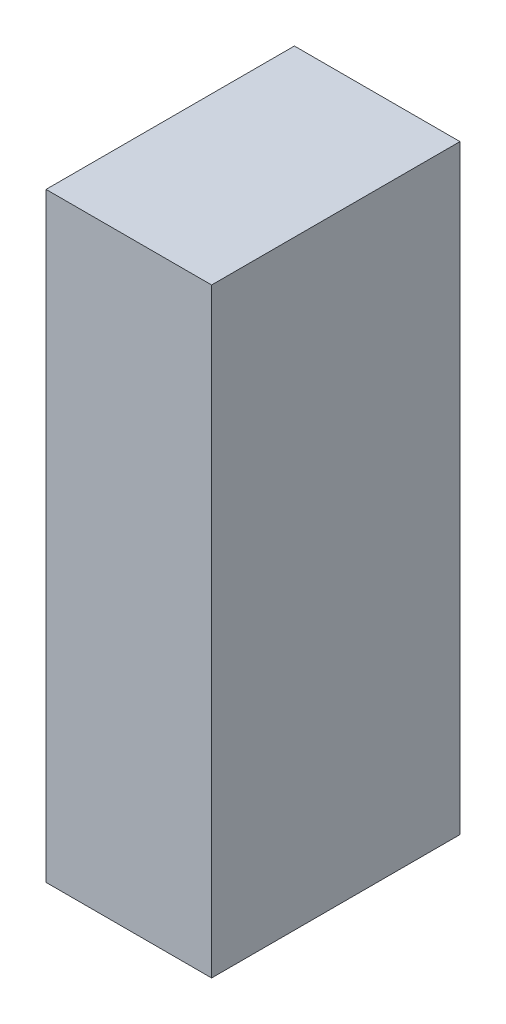
ISO-10303-21;
HEADER;
FILE_DESCRIPTION(('STEP AP214'),'2;1');
FILE_NAME('part.step','',(''),(''),'','','');
FILE_SCHEMA(('AUTOMOTIVE_DESIGN { 1 0 10303 214 1 1 1 1 }'));
ENDSEC;
DATA;
#1=APPLICATION_CONTEXT('core data for automotive mechanical design processes');
#2=APPLICATION_PROTOCOL_DEFINITION('international standard','automotive_design',2000,#1);
#3=PRODUCT_CONTEXT('',#1,'mechanical');
#4=PRODUCT('Part','Part','',(#3));
#5=PRODUCT_RELATED_PRODUCT_CATEGORY('part','',(#4));
#6=PRODUCT_DEFINITION_FORMATION('','',#4);
#7=PRODUCT_DEFINITION_CONTEXT('part definition',#1,'design');
#8=PRODUCT_DEFINITION('design','',#6,#7);
#9=PRODUCT_DEFINITION_SHAPE('','',#8);
#10=(LENGTH_UNIT() NAMED_UNIT(*) SI_UNIT(.MILLI.,.METRE.));
#11=(NAMED_UNIT(*) PLANE_ANGLE_UNIT() SI_UNIT($,.RADIAN.));
#12=(NAMED_UNIT(*) SI_UNIT($,.STERADIAN.) SOLID_ANGLE_UNIT());
#13=UNCERTAINTY_MEASURE_WITH_UNIT(LENGTH_MEASURE(1.E-05),#10,'distance_accuracy_value','');
#14=(GEOMETRIC_REPRESENTATION_CONTEXT(3) GLOBAL_UNCERTAINTY_ASSIGNED_CONTEXT((#13)) GLOBAL_UNIT_ASSIGNED_CONTEXT((#10,
#11,#12)) REPRESENTATION_CONTEXT('',''));
#15=CARTESIAN_POINT('',(0.,0.,0.));
#16=DIRECTION('',(0.,0.,1.));
#17=DIRECTION('',(1.,0.,0.));
#18=AXIS2_PLACEMENT_3D('',#15,#16,#17);
#19=CARTESIAN_POINT('',(0.699992179626449,0.724992261998693,0.));
#20=DIRECTION('',(-1.,1.19248806385031E-08,0.));
#21=DIRECTION('',(-1.19248806385031E-08,-1.,0.));
#22=AXIS2_PLACEMENT_3D('',#19,#20,#21);
#23=PLANE('',#22);
#24=DIRECTION('',(-1.1924880607005E-08,-1.,0.));
#25=VECTOR('',#24,1.);
#26=CARTESIAN_POINT('',(0.699992179626449,0.724992261998693,0.));
#27=LINE('',#26,#25);
#28=CARTESIAN_POINT('',(0.699992179626449,0.724992261998693,0.));
#29=VERTEX_POINT('',#28);
#30=CARTESIAN_POINT('',(0.699992162335406,-0.725004686243494,0.));
#31=VERTEX_POINT('',#30);
#32=EDGE_CURVE('E11',#29,#31,#27,.T.);
#33=ORIENTED_EDGE('',*,*,#32,.T.);
#34=DIRECTION('',(0.,0.,1.));
#35=VECTOR('',#34,1.);
#36=CARTESIAN_POINT('',(0.699992162335408,-0.725004686243494,0.));
#37=LINE('',#36,#35);
#38=CARTESIAN_POINT('',(0.699992162335406,-0.725004686243494,0.599998772144318));
#39=VERTEX_POINT('',#38);
#40=EDGE_CURVE('E88',#31,#39,#37,.T.);
#41=ORIENTED_EDGE('',*,*,#40,.T.);
#42=DIRECTION('',(-1.1924880607005E-08,-1.,0.));
#43=VECTOR('',#42,1.);
#44=CARTESIAN_POINT('',(0.699992179626449,0.724992261998693,0.599998772144318));
#45=LINE('',#44,#43);
#46=CARTESIAN_POINT('',(0.699992179626449,0.724992261998693,0.599998772144318));
#47=VERTEX_POINT('',#46);
#48=EDGE_CURVE('E83',#47,#39,#45,.T.);
#49=ORIENTED_EDGE('',*,*,#48,.F.);
#50=DIRECTION('',(0.,0.,1.));
#51=VECTOR('',#50,1.);
#52=CARTESIAN_POINT('',(0.699992179626449,0.724992261998705,0.));
#53=LINE('',#52,#51);
#54=EDGE_CURVE('E72',#29,#47,#53,.T.);
#55=ORIENTED_EDGE('',*,*,#54,.F.);
#56=EDGE_LOOP('',(#33,#41,#49,#55));
#57=FACE_BOUND('',#56,.T.);
#58=ADVANCED_FACE('F17',(#57),#23,.T.);
#59=CARTESIAN_POINT('',(0.699992162335406,-0.725004686243494,0.));
#60=DIRECTION('',(-1.19248806385031E-08,-1.,0.));
#61=DIRECTION('',(1.,-1.19248806385031E-08,0.));
#62=AXIS2_PLACEMENT_3D('',#59,#60,#61);
#63=PLANE('',#62);
#64=DIRECTION('',(1.,-1.19248805568155E-08,0.));
#65=VECTOR('',#64,1.);
#66=CARTESIAN_POINT('',(0.699992162335406,-0.725004686243494,0.));
#67=LINE('',#66,#65);
#68=CARTESIAN_POINT('',(1.09999368821431,-0.725004691013453,0.));
#69=VERTEX_POINT('',#68);
#70=EDGE_CURVE('E24',#31,#69,#67,.T.);
#71=ORIENTED_EDGE('',*,*,#70,.T.);
#72=DIRECTION('',(0.,0.,1.));
#73=VECTOR('',#72,1.);
#74=CARTESIAN_POINT('',(1.09999368821431,-0.725004691013465,0.));
#75=LINE('',#74,#73);
#76=CARTESIAN_POINT('',(1.09999368821431,-0.725004691013453,0.599998772144318));
#77=VERTEX_POINT('',#76);
#78=EDGE_CURVE('E85',#69,#77,#75,.T.);
#79=ORIENTED_EDGE('',*,*,#78,.T.);
#80=DIRECTION('',(1.,-1.19248805568155E-08,0.));
#81=VECTOR('',#80,1.);
#82=CARTESIAN_POINT('',(0.699992162335406,-0.725004686243494,0.599998772144318));
#83=LINE('',#82,#81);
#84=EDGE_CURVE('E66',#39,#77,#83,.T.);
#85=ORIENTED_EDGE('',*,*,#84,.F.);
#86=ORIENTED_EDGE('',*,*,#40,.F.);
#87=EDGE_LOOP('',(#71,#79,#85,#86));
#88=FACE_BOUND('',#87,.T.);
#89=ADVANCED_FACE('F89',(#88),#63,.T.);
#90=CARTESIAN_POINT('',(1.09999368821431,-0.725004691013453,0.));
#91=DIRECTION('',(1.,-1.19248806385031E-08,0.));
#92=DIRECTION('',(1.19248806385031E-08,1.,0.));
#93=AXIS2_PLACEMENT_3D('',#90,#91,#92);
#94=PLANE('',#93);
#95=DIRECTION('',(1.19248806835723E-08,1.,0.));
#96=VECTOR('',#95,1.);
#97=CARTESIAN_POINT('',(1.09999368821431,-0.725004691013453,0.));
#98=LINE('',#97,#96);
#99=CARTESIAN_POINT('',(1.09999370550535,0.724992257228735,0.));
#100=VERTEX_POINT('',#99);
#101=EDGE_CURVE('E62',#69,#100,#98,.T.);
#102=ORIENTED_EDGE('',*,*,#101,.T.);
#103=DIRECTION('',(0.,0.,1.));
#104=VECTOR('',#103,1.);
#105=CARTESIAN_POINT('',(1.09999370550535,0.724992257228735,0.));
#106=LINE('',#105,#104);
#107=CARTESIAN_POINT('',(1.09999370550535,0.724992257228735,0.599998772144318));
#108=VERTEX_POINT('',#107);
#109=EDGE_CURVE('E55',#100,#108,#106,.T.);
#110=ORIENTED_EDGE('',*,*,#109,.T.);
#111=DIRECTION('',(1.19248806835723E-08,1.,0.));
#112=VECTOR('',#111,1.);
#113=CARTESIAN_POINT('',(1.09999368821431,-0.725004691013453,0.599998772144318));
#114=LINE('',#113,#112);
#115=EDGE_CURVE('E59',#77,#108,#114,.T.);
#116=ORIENTED_EDGE('',*,*,#115,.F.);
#117=ORIENTED_EDGE('',*,*,#78,.F.);
#118=EDGE_LOOP('',(#102,#110,#116,#117));
#119=FACE_BOUND('',#118,.T.);
#120=ADVANCED_FACE('F57',(#119),#94,.T.);
#121=CARTESIAN_POINT('',(1.09999370550535,0.724992257228735,0.));
#122=DIRECTION('',(1.19248806385031E-08,1.,0.));
#123=DIRECTION('',(-1.,1.19248806385031E-08,0.));
#124=AXIS2_PLACEMENT_3D('',#121,#122,#123);
#125=PLANE('',#124);
#126=DIRECTION('',(-1.,1.19248805568155E-08,0.));
#127=VECTOR('',#126,1.);
#128=CARTESIAN_POINT('',(1.09999370550535,0.724992257228735,0.));
#129=LINE('',#128,#127);
#130=EDGE_CURVE('E65',#100,#29,#129,.T.);
#131=ORIENTED_EDGE('',*,*,#130,.T.);
#132=ORIENTED_EDGE('',*,*,#54,.T.);
#133=DIRECTION('',(-1.,1.19248805568155E-08,0.));
#134=VECTOR('',#133,1.);
#135=CARTESIAN_POINT('',(1.09999370550535,0.724992257228735,0.599998772144318));
#136=LINE('',#135,#134);
#137=EDGE_CURVE('E70',#108,#47,#136,.T.);
#138=ORIENTED_EDGE('',*,*,#137,.F.);
#139=ORIENTED_EDGE('',*,*,#109,.F.);
#140=EDGE_LOOP('',(#131,#132,#138,#139));
#141=FACE_BOUND('',#140,.T.);
#142=ADVANCED_FACE('F71',(#141),#125,.T.);
#143=CARTESIAN_POINT('',(119.549995422363,-239.175003051758,0.599998772144318));
#144=DIRECTION('',(0.,0.,1.));
#145=DIRECTION('',(1.19248806385031E-08,1.,0.));
#146=AXIS2_PLACEMENT_3D('',#143,#144,#145);
#147=PLANE('',#146);
#148=ORIENTED_EDGE('',*,*,#48,.T.);
#149=ORIENTED_EDGE('',*,*,#84,.T.);
#150=ORIENTED_EDGE('',*,*,#115,.T.);
#151=ORIENTED_EDGE('',*,*,#137,.T.);
#152=EDGE_LOOP('',(#148,#149,#150,#151));
#153=FACE_BOUND('',#152,.T.);
#154=ADVANCED_FACE('F76',(#153),#147,.T.);
#155=CARTESIAN_POINT('',(119.549995422363,-239.175003051758,0.));
#156=DIRECTION('',(0.,0.,1.));
#157=DIRECTION('',(1.19248806385031E-08,1.,0.));
#158=AXIS2_PLACEMENT_3D('',#155,#156,#157);
#159=PLANE('',#158);
#160=ORIENTED_EDGE('',*,*,#130,.F.);
#161=ORIENTED_EDGE('',*,*,#101,.F.);
#162=ORIENTED_EDGE('',*,*,#70,.F.);
#163=ORIENTED_EDGE('',*,*,#32,.F.);
#164=EDGE_LOOP('',(#160,#161,#162,#163));
#165=FACE_BOUND('',#164,.T.);
#166=ADVANCED_FACE('F91',(#165),#159,.F.);
#167=CLOSED_SHELL('',(#58,#89,#120,#142,#154,#166));
#168=MANIFOLD_SOLID_BREP('B1',#167);
#169=ADVANCED_BREP_SHAPE_REPRESENTATION('',(#18,#168),#14);
#170=SHAPE_DEFINITION_REPRESENTATION(#9,#169);
ENDSEC;
END-ISO-10303-21;
